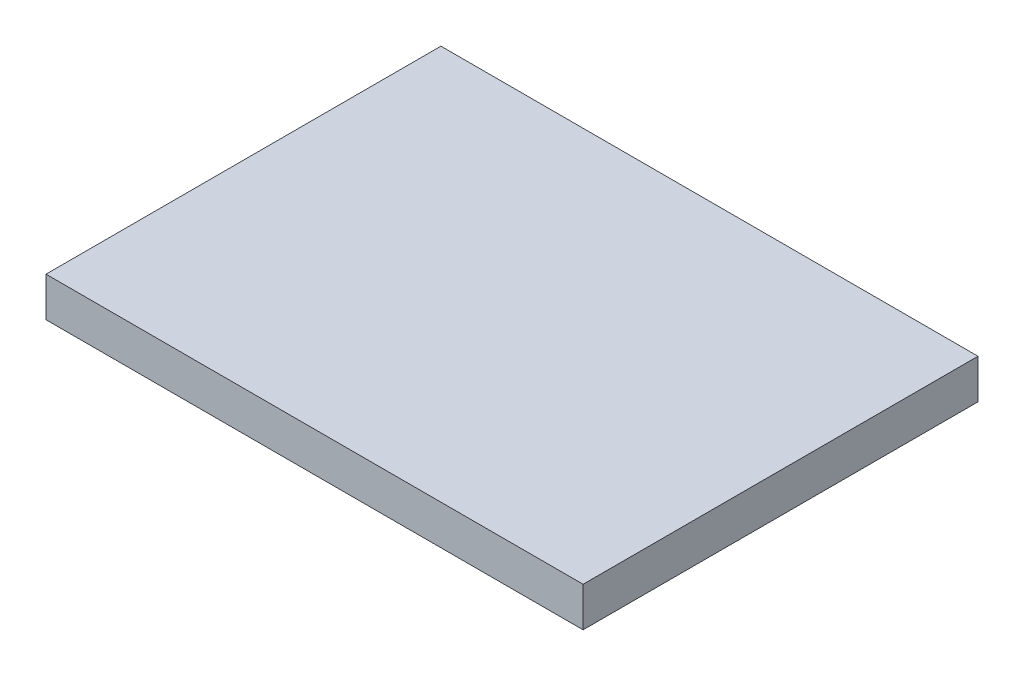
ISO-10303-21;
HEADER;
FILE_DESCRIPTION(('STEP AP214'),'2;1');
FILE_NAME('part.step','',(''),(''),'','','');
FILE_SCHEMA(('AUTOMOTIVE_DESIGN { 1 0 10303 214 1 1 1 1 }'));
ENDSEC;
DATA;
#1=APPLICATION_CONTEXT('core data for automotive mechanical design processes');
#2=APPLICATION_PROTOCOL_DEFINITION('international standard','automotive_design',2000,#1);
#3=PRODUCT_CONTEXT('',#1,'mechanical');
#4=PRODUCT('Part','Part','',(#3));
#5=PRODUCT_RELATED_PRODUCT_CATEGORY('part','',(#4));
#6=PRODUCT_DEFINITION_FORMATION('','',#4);
#7=PRODUCT_DEFINITION_CONTEXT('part definition',#1,'design');
#8=PRODUCT_DEFINITION('design','',#6,#7);
#9=PRODUCT_DEFINITION_SHAPE('','',#8);
#10=(LENGTH_UNIT() NAMED_UNIT(*) SI_UNIT(.MILLI.,.METRE.));
#11=(NAMED_UNIT(*) PLANE_ANGLE_UNIT() SI_UNIT($,.RADIAN.));
#12=(NAMED_UNIT(*) SI_UNIT($,.STERADIAN.) SOLID_ANGLE_UNIT());
#13=UNCERTAINTY_MEASURE_WITH_UNIT(LENGTH_MEASURE(1.E-05),#10,'distance_accuracy_value','');
#14=(GEOMETRIC_REPRESENTATION_CONTEXT(3) GLOBAL_UNCERTAINTY_ASSIGNED_CONTEXT((#13)) GLOBAL_UNIT_ASSIGNED_CONTEXT((#10,
#11,#12)) REPRESENTATION_CONTEXT('',''));
#15=CARTESIAN_POINT('',(0.,0.,0.));
#16=DIRECTION('',(0.,0.,1.));
#17=DIRECTION('',(1.,0.,0.));
#18=AXIS2_PLACEMENT_3D('',#15,#16,#17);
#19=CARTESIAN_POINT('',(0.,25.,0.));
#20=DIRECTION('',(1.,0.,0.));
#21=DIRECTION('',(0.,0.,-1.));
#22=AXIS2_PLACEMENT_3D('',#19,#20,#21);
#23=PLANE('',#22);
#24=DIRECTION('',(0.,0.,1.));
#25=VECTOR('',#24,1.);
#26=CARTESIAN_POINT('',(0.,0.,0.));
#27=LINE('',#26,#25);
#28=CARTESIAN_POINT('',(0.,0.,-250.));
#29=VERTEX_POINT('',#28);
#30=CARTESIAN_POINT('',(0.,0.,0.));
#31=VERTEX_POINT('',#30);
#32=EDGE_CURVE('E96',#29,#31,#27,.T.);
#33=ORIENTED_EDGE('',*,*,#32,.T.);
#34=DIRECTION('',(0.,-1.,0.));
#35=VECTOR('',#34,1.);
#36=CARTESIAN_POINT('',(0.,25.,0.));
#37=LINE('',#36,#35);
#38=CARTESIAN_POINT('',(0.,25.,0.));
#39=VERTEX_POINT('',#38);
#40=EDGE_CURVE('E11',#39,#31,#37,.T.);
#41=ORIENTED_EDGE('',*,*,#40,.F.);
#42=DIRECTION('',(0.,0.,1.));
#43=VECTOR('',#42,1.);
#44=CARTESIAN_POINT('',(0.,25.,0.));
#45=LINE('',#44,#43);
#46=CARTESIAN_POINT('',(0.,25.,-250.));
#47=VERTEX_POINT('',#46);
#48=EDGE_CURVE('E84',#47,#39,#45,.T.);
#49=ORIENTED_EDGE('',*,*,#48,.F.);
#50=DIRECTION('',(0.,-1.,0.));
#51=VECTOR('',#50,1.);
#52=CARTESIAN_POINT('',(0.,25.,-250.));
#53=LINE('',#52,#51);
#54=EDGE_CURVE('E92',#47,#29,#53,.T.);
#55=ORIENTED_EDGE('',*,*,#54,.T.);
#56=EDGE_LOOP('',(#33,#41,#49,#55));
#57=FACE_BOUND('',#56,.T.);
#58=ADVANCED_FACE('F33',(#57),#23,.F.);
#59=CARTESIAN_POINT('',(0.,25.,0.));
#60=DIRECTION('',(0.,0.,-1.));
#61=DIRECTION('',(-1.,0.,0.));
#62=AXIS2_PLACEMENT_3D('',#59,#60,#61);
#63=PLANE('',#62);
#64=DIRECTION('',(1.,0.,0.));
#65=VECTOR('',#64,1.);
#66=CARTESIAN_POINT('',(0.,0.,0.));
#67=LINE('',#66,#65);
#68=CARTESIAN_POINT('',(340.,0.,0.));
#69=VERTEX_POINT('',#68);
#70=EDGE_CURVE('E88',#31,#69,#67,.T.);
#71=ORIENTED_EDGE('',*,*,#70,.T.);
#72=DIRECTION('',(0.,-1.,0.));
#73=VECTOR('',#72,1.);
#74=CARTESIAN_POINT('',(340.,25.,0.));
#75=LINE('',#74,#73);
#76=CARTESIAN_POINT('',(340.,25.,0.));
#77=VERTEX_POINT('',#76);
#78=EDGE_CURVE('E41',#77,#69,#75,.T.);
#79=ORIENTED_EDGE('',*,*,#78,.F.);
#80=DIRECTION('',(1.,0.,0.));
#81=VECTOR('',#80,1.);
#82=CARTESIAN_POINT('',(0.,25.,0.));
#83=LINE('',#82,#81);
#84=EDGE_CURVE('E79',#39,#77,#83,.T.);
#85=ORIENTED_EDGE('',*,*,#84,.F.);
#86=ORIENTED_EDGE('',*,*,#40,.T.);
#87=EDGE_LOOP('',(#71,#79,#85,#86));
#88=FACE_BOUND('',#87,.T.);
#89=ADVANCED_FACE('F87',(#88),#63,.F.);
#90=CARTESIAN_POINT('',(340.,25.,0.));
#91=DIRECTION('',(-1.,0.,0.));
#92=DIRECTION('',(0.,0.,1.));
#93=AXIS2_PLACEMENT_3D('',#90,#91,#92);
#94=PLANE('',#93);
#95=DIRECTION('',(0.,0.,-1.));
#96=VECTOR('',#95,1.);
#97=CARTESIAN_POINT('',(340.,0.,0.));
#98=LINE('',#97,#96);
#99=CARTESIAN_POINT('',(340.,0.,-250.));
#100=VERTEX_POINT('',#99);
#101=EDGE_CURVE('E66',#69,#100,#98,.T.);
#102=ORIENTED_EDGE('',*,*,#101,.T.);
#103=DIRECTION('',(0.,-1.,0.));
#104=VECTOR('',#103,1.);
#105=CARTESIAN_POINT('',(340.,25.,-250.));
#106=LINE('',#105,#104);
#107=CARTESIAN_POINT('',(340.,25.,-250.));
#108=VERTEX_POINT('',#107);
#109=EDGE_CURVE('E89',#108,#100,#106,.T.);
#110=ORIENTED_EDGE('',*,*,#109,.F.);
#111=DIRECTION('',(0.,0.,-1.));
#112=VECTOR('',#111,1.);
#113=CARTESIAN_POINT('',(340.,25.,0.));
#114=LINE('',#113,#112);
#115=EDGE_CURVE('E82',#77,#108,#114,.T.);
#116=ORIENTED_EDGE('',*,*,#115,.F.);
#117=ORIENTED_EDGE('',*,*,#78,.T.);
#118=EDGE_LOOP('',(#102,#110,#116,#117));
#119=FACE_BOUND('',#118,.T.);
#120=ADVANCED_FACE('F90',(#119),#94,.F.);
#121=CARTESIAN_POINT('',(0.,25.,-250.));
#122=DIRECTION('',(0.,0.,1.));
#123=DIRECTION('',(1.,0.,0.));
#124=AXIS2_PLACEMENT_3D('',#121,#122,#123);
#125=PLANE('',#124);
#126=DIRECTION('',(-1.,0.,0.));
#127=VECTOR('',#126,1.);
#128=CARTESIAN_POINT('',(0.,0.,-250.));
#129=LINE('',#128,#127);
#130=EDGE_CURVE('E72',#100,#29,#129,.T.);
#131=ORIENTED_EDGE('',*,*,#130,.T.);
#132=ORIENTED_EDGE('',*,*,#54,.F.);
#133=DIRECTION('',(-1.,0.,0.));
#134=VECTOR('',#133,1.);
#135=CARTESIAN_POINT('',(0.,25.,-250.));
#136=LINE('',#135,#134);
#137=EDGE_CURVE('E49',#108,#47,#136,.T.);
#138=ORIENTED_EDGE('',*,*,#137,.F.);
#139=ORIENTED_EDGE('',*,*,#109,.T.);
#140=EDGE_LOOP('',(#131,#132,#138,#139));
#141=FACE_BOUND('',#140,.T.);
#142=ADVANCED_FACE('F103',(#141),#125,.F.);
#143=CARTESIAN_POINT('',(0.,25.,0.));
#144=DIRECTION('',(0.,-1.,0.));
#145=DIRECTION('',(0.,0.,-1.));
#146=AXIS2_PLACEMENT_3D('',#143,#144,#145);
#147=PLANE('',#146);
#148=ORIENTED_EDGE('',*,*,#48,.T.);
#149=ORIENTED_EDGE('',*,*,#84,.T.);
#150=ORIENTED_EDGE('',*,*,#115,.T.);
#151=ORIENTED_EDGE('',*,*,#137,.T.);
#152=EDGE_LOOP('',(#148,#149,#150,#151));
#153=FACE_BOUND('',#152,.T.);
#154=ADVANCED_FACE('F80',(#153),#147,.F.);
#155=CARTESIAN_POINT('',(0.,0.,0.));
#156=DIRECTION('',(0.,-1.,0.));
#157=DIRECTION('',(0.,0.,-1.));
#158=AXIS2_PLACEMENT_3D('',#155,#156,#157);
#159=PLANE('',#158);
#160=ORIENTED_EDGE('',*,*,#32,.F.);
#161=ORIENTED_EDGE('',*,*,#130,.F.);
#162=ORIENTED_EDGE('',*,*,#101,.F.);
#163=ORIENTED_EDGE('',*,*,#70,.F.);
#164=EDGE_LOOP('',(#160,#161,#162,#163));
#165=FACE_BOUND('',#164,.T.);
#166=ADVANCED_FACE('F106',(#165),#159,.T.);
#167=CLOSED_SHELL('',(#58,#89,#120,#142,#154,#166));
#168=MANIFOLD_SOLID_BREP('B2',#167);
#169=ADVANCED_BREP_SHAPE_REPRESENTATION('',(#18,#168),#14);
#170=SHAPE_DEFINITION_REPRESENTATION(#9,#169);
ENDSEC;
END-ISO-10303-21;
